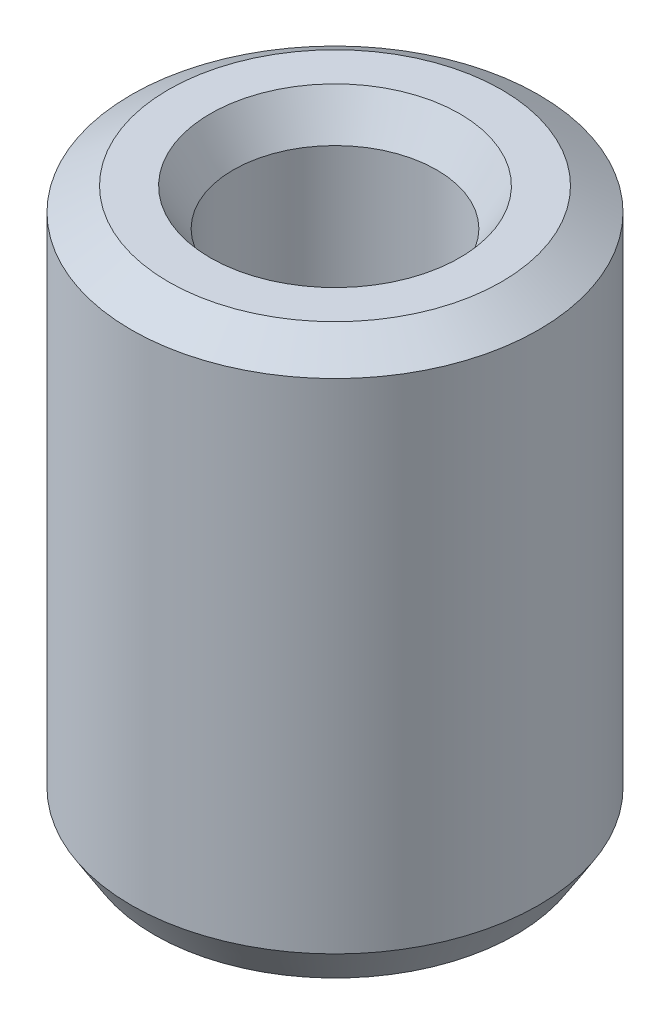
ISO-10303-21;
HEADER;
FILE_DESCRIPTION(('STEP AP214'),'2;1');
FILE_NAME('part.step','',(''),(''),'','','');
FILE_SCHEMA(('AUTOMOTIVE_DESIGN { 1 0 10303 214 1 1 1 1 }'));
ENDSEC;
DATA;
#1=APPLICATION_CONTEXT('core data for automotive mechanical design processes');
#2=APPLICATION_PROTOCOL_DEFINITION('international standard','automotive_design',2000,#1);
#3=PRODUCT_CONTEXT('',#1,'mechanical');
#4=PRODUCT('Part','Part','',(#3));
#5=PRODUCT_RELATED_PRODUCT_CATEGORY('part','',(#4));
#6=PRODUCT_DEFINITION_FORMATION('','',#4);
#7=PRODUCT_DEFINITION_CONTEXT('part definition',#1,'design');
#8=PRODUCT_DEFINITION('design','',#6,#7);
#9=PRODUCT_DEFINITION_SHAPE('','',#8);
#10=(LENGTH_UNIT() NAMED_UNIT(*) SI_UNIT(.MILLI.,.METRE.));
#11=(NAMED_UNIT(*) PLANE_ANGLE_UNIT() SI_UNIT($,.RADIAN.));
#12=(NAMED_UNIT(*) SI_UNIT($,.STERADIAN.) SOLID_ANGLE_UNIT());
#13=UNCERTAINTY_MEASURE_WITH_UNIT(LENGTH_MEASURE(1.E-05),#10,'distance_accuracy_value','');
#14=(GEOMETRIC_REPRESENTATION_CONTEXT(3) GLOBAL_UNCERTAINTY_ASSIGNED_CONTEXT((#13)) GLOBAL_UNIT_ASSIGNED_CONTEXT((#10,
#11,#12)) REPRESENTATION_CONTEXT('',''));
#15=CARTESIAN_POINT('',(0.,0.,0.));
#16=DIRECTION('',(0.,0.,1.));
#17=DIRECTION('',(1.,0.,0.));
#18=AXIS2_PLACEMENT_3D('',#15,#16,#17);
#19=CARTESIAN_POINT('',(0.,20.5635984561247,0.));
#20=DIRECTION('',(0.,-1.,0.));
#21=DIRECTION('',(0.,0.,-1.));
#22=AXIS2_PLACEMENT_3D('',#19,#20,#21);
#23=CYLINDRICAL_SURFACE('',#22,7.5);
#24=CARTESIAN_POINT('',(0.,1.36767746203423,0.));
#25=DIRECTION('',(0.,1.,0.));
#26=DIRECTION('',(0.,0.,1.));
#27=AXIS2_PLACEMENT_3D('',#24,#25,#26);
#28=CIRCLE('',#27,7.5);
#29=CARTESIAN_POINT('',(0.,1.36767746203423,7.5));
#30=VERTEX_POINT('',#29);
#31=EDGE_CURVE('E10',#30,#30,#28,.T.);
#32=ORIENTED_EDGE('',*,*,#31,.T.);
#33=EDGE_LOOP('',(#32));
#34=FACE_BOUND('',#33,.T.);
#35=CARTESIAN_POINT('',(0.,19.7164139908633,0.));
#36=DIRECTION('',(0.,1.,0.));
#37=DIRECTION('',(0.,0.,1.));
#38=AXIS2_PLACEMENT_3D('',#35,#36,#37);
#39=CIRCLE('',#38,7.5);
#40=CARTESIAN_POINT('',(0.,19.7164139908633,7.5));
#41=VERTEX_POINT('',#40);
#42=EDGE_CURVE('E50',#41,#41,#39,.F.);
#43=ORIENTED_EDGE('',*,*,#42,.T.);
#44=EDGE_LOOP('',(#43));
#45=FACE_BOUND('',#44,.T.);
#46=ADVANCED_FACE('F39',(#34,#45),#23,.T.);
#47=CARTESIAN_POINT('',(0.,20.5635984561247,0.));
#48=DIRECTION('',(0.,1.,0.));
#49=DIRECTION('',(0.,0.,1.));
#50=AXIS2_PLACEMENT_3D('',#47,#48,#49);
#51=PLANE('',#50);
#52=CARTESIAN_POINT('',(0.,20.5635984561247,0.));
#53=DIRECTION('',(0.,1.,0.));
#54=DIRECTION('',(0.,0.,1.));
#55=AXIS2_PLACEMENT_3D('',#52,#53,#54);
#56=CIRCLE('',#55,4.59432268061702);
#57=CARTESIAN_POINT('',(0.,20.5635984561247,4.59432268061701));
#58=VERTEX_POINT('',#57);
#59=EDGE_CURVE('E58',#58,#58,#56,.F.);
#60=ORIENTED_EDGE('',*,*,#59,.T.);
#61=EDGE_LOOP('',(#60));
#62=FACE_BOUND('',#61,.T.);
#63=CARTESIAN_POINT('',(0.,20.5635984561247,0.));
#64=DIRECTION('',(0.,1.,0.));
#65=DIRECTION('',(0.,0.,1.));
#66=AXIS2_PLACEMENT_3D('',#63,#64,#65);
#67=CIRCLE('',#66,6.13232253796576);
#68=CARTESIAN_POINT('',(0.,20.5635984561247,6.13232253796576));
#69=VERTEX_POINT('',#68);
#70=EDGE_CURVE('E61',#69,#69,#67,.T.);
#71=ORIENTED_EDGE('',*,*,#70,.T.);
#72=EDGE_LOOP('',(#71));
#73=FACE_BOUND('',#72,.T.);
#74=ADVANCED_FACE('F88',(#62,#73),#51,.T.);
#75=CARTESIAN_POINT('',(0.,0.,0.));
#76=DIRECTION('',(0.,1.,0.));
#77=DIRECTION('',(0.,0.,1.));
#78=AXIS2_PLACEMENT_3D('',#75,#76,#77);
#79=PLANE('',#78);
#80=CARTESIAN_POINT('',(0.,0.,0.));
#81=DIRECTION('',(0.,1.,0.));
#82=DIRECTION('',(0.,0.,1.));
#83=AXIS2_PLACEMENT_3D('',#80,#81,#82);
#84=CIRCLE('',#83,5.1148156773898);
#85=CARTESIAN_POINT('',(0.,0.,5.1148156773898));
#86=VERTEX_POINT('',#85);
#87=EDGE_CURVE('E51',#86,#86,#84,.T.);
#88=ORIENTED_EDGE('',*,*,#87,.T.);
#89=EDGE_LOOP('',(#88));
#90=FACE_BOUND('',#89,.T.);
#91=CARTESIAN_POINT('',(0.,0.,0.));
#92=DIRECTION('',(0.,1.,0.));
#93=DIRECTION('',(0.,0.,1.));
#94=AXIS2_PLACEMENT_3D('',#91,#92,#93);
#95=CIRCLE('',#94,6.65281553473856);
#96=CARTESIAN_POINT('',(0.,0.,6.65281553473856));
#97=VERTEX_POINT('',#96);
#98=EDGE_CURVE('E54',#97,#97,#95,.F.);
#99=ORIENTED_EDGE('',*,*,#98,.T.);
#100=EDGE_LOOP('',(#99));
#101=FACE_BOUND('',#100,.T.);
#102=ADVANCED_FACE('F83',(#90,#101),#79,.F.);
#103=CARTESIAN_POINT('',(0.,20.5635984561247,0.));
#104=DIRECTION('',(0.,-1.,0.));
#105=DIRECTION('',(0.,0.,-1.));
#106=AXIS2_PLACEMENT_3D('',#103,#104,#105);
#107=CYLINDRICAL_SURFACE('',#106,3.74713821535556);
#108=CARTESIAN_POINT('',(0.,19.1959209940905,0.));
#109=DIRECTION('',(0.,1.,0.));
#110=DIRECTION('',(0.,0.,1.));
#111=AXIS2_PLACEMENT_3D('',#108,#109,#110);
#112=CIRCLE('',#111,3.74713821535556);
#113=CARTESIAN_POINT('',(0.,19.1959209940905,3.74713821535556));
#114=VERTEX_POINT('',#113);
#115=EDGE_CURVE('E67',#114,#114,#112,.T.);
#116=ORIENTED_EDGE('',*,*,#115,.T.);
#117=EDGE_LOOP('',(#116));
#118=FACE_BOUND('',#117,.T.);
#119=CARTESIAN_POINT('',(0.,0.847184465261445,0.));
#120=DIRECTION('',(0.,1.,0.));
#121=DIRECTION('',(0.,0.,1.));
#122=AXIS2_PLACEMENT_3D('',#119,#120,#121);
#123=CIRCLE('',#122,3.74713821535556);
#124=CARTESIAN_POINT('',(0.,0.847184465261445,3.74713821535556));
#125=VERTEX_POINT('',#124);
#126=EDGE_CURVE('E69',#125,#125,#123,.F.);
#127=ORIENTED_EDGE('',*,*,#126,.T.);
#128=EDGE_LOOP('',(#127));
#129=FACE_BOUND('',#128,.T.);
#130=ADVANCED_FACE('F71',(#118,#129),#107,.F.);
#131=CARTESIAN_POINT('',(0.,19.1959209940905,0.));
#132=DIRECTION('',(0.,1.,0.));
#133=DIRECTION('',(0.,0.,1.));
#134=AXIS2_PLACEMENT_3D('',#131,#132,#133);
#135=CONICAL_SURFACE('',#134,3.74713821535556,0.554586013082697);
#136=CARTESIAN_POINT('',(0.,20.5635984561247,4.59432268061701));
#137=CARTESIAN_POINT('',(0.,20.5493518158952,4.58549784243721));
#138=CARTESIAN_POINT('',(0.,20.5351051756657,4.5766730042574));
#139=CARTESIAN_POINT('',(0.,20.5066118952067,4.55902332789779));
#140=CARTESIAN_POINT('',(0.,20.4923652549771,4.55019848971798));
#141=CARTESIAN_POINT('',(0.,20.4638719745181,4.53254881335837));
#142=CARTESIAN_POINT('',(0.,20.4496253342886,4.52372397517856));
#143=CARTESIAN_POINT('',(0.,20.4211320538295,4.50607429881895));
#144=CARTESIAN_POINT('',(0.,20.4068854136,4.49724946063914));
#145=CARTESIAN_POINT('',(0.,20.3783921331409,4.47959978427953));
#146=CARTESIAN_POINT('',(0.,20.3641454929114,4.47077494609972));
#147=CARTESIAN_POINT('',(0.,20.3356522124524,4.45312526974011));
#148=CARTESIAN_POINT('',(0.,20.3214055722229,4.4443004315603));
#149=CARTESIAN_POINT('',(0.,20.2929122917638,4.42665075520069));
#150=CARTESIAN_POINT('',(0.,20.2786656515343,4.41782591702088));
#151=CARTESIAN_POINT('',(0.,20.2501723710752,4.40017624066127));
#152=CARTESIAN_POINT('',(0.,20.2359257308457,4.39135140248146));
#153=CARTESIAN_POINT('',(0.,20.2074324503867,4.37370172612184));
#154=CARTESIAN_POINT('',(0.,20.1931858101571,4.36487688794204));
#155=CARTESIAN_POINT('',(0.,20.1646925296981,4.34722721158242));
#156=CARTESIAN_POINT('',(0.,20.1504458894686,4.33840237340262));
#157=CARTESIAN_POINT('',(0.,20.1219526090095,4.320752697043));
#158=CARTESIAN_POINT('',(0.,20.10770596878,4.3119278588632));
#159=CARTESIAN_POINT('',(0.,20.079212688321,4.29427818250358));
#160=CARTESIAN_POINT('',(0.,20.0649660480914,4.28545334432378));
#161=CARTESIAN_POINT('',(0.,20.0364727676324,4.26780366796416));
#162=CARTESIAN_POINT('',(0.,20.0222261274029,4.25897882978436));
#163=CARTESIAN_POINT('',(0.,19.9937328469438,4.24132915342474));
#164=CARTESIAN_POINT('',(0.,19.9794862067143,4.23250431524494));
#165=CARTESIAN_POINT('',(0.,19.9509929262552,4.21485463888532));
#166=CARTESIAN_POINT('',(0.,19.9367462860257,4.20602980070552));
#167=CARTESIAN_POINT('',(0.,19.9082530055667,4.1883801243459));
#168=CARTESIAN_POINT('',(0.,19.8940063653371,4.1795552861661));
#169=CARTESIAN_POINT('',(0.,19.8655130848781,4.16190560980648));
#170=CARTESIAN_POINT('',(0.,19.8512664446486,4.15308077162668));
#171=CARTESIAN_POINT('',(0.,19.8227731641895,4.13543109526706));
#172=CARTESIAN_POINT('',(0.,19.80852652396,4.12660625708725));
#173=CARTESIAN_POINT('',(0.,19.780033243501,4.10895658072764));
#174=CARTESIAN_POINT('',(0.,19.7657866032714,4.10013174254783));
#175=CARTESIAN_POINT('',(0.,19.7372933228124,4.08248206618822));
#176=CARTESIAN_POINT('',(0.,19.7230466825829,4.07365722800841));
#177=CARTESIAN_POINT('',(0.,19.6945534021238,4.0560075516488));
#178=CARTESIAN_POINT('',(0.,19.6803067618943,4.04718271346899));
#179=CARTESIAN_POINT('',(0.,19.6518134814353,4.02953303710938));
#180=CARTESIAN_POINT('',(0.,19.6375668412057,4.02070819892957));
#181=CARTESIAN_POINT('',(0.,19.6090735607467,4.00305852256996));
#182=CARTESIAN_POINT('',(0.,19.5948269205172,3.99423368439015));
#183=CARTESIAN_POINT('',(0.,19.5663336400581,3.97658400803054));
#184=CARTESIAN_POINT('',(0.,19.5520869998286,3.96775916985073));
#185=CARTESIAN_POINT('',(0.,19.5235937193695,3.95010949349112));
#186=CARTESIAN_POINT('',(0.,19.50934707914,3.94128465531131));
#187=CARTESIAN_POINT('',(0.,19.480853798681,3.9236349789517));
#188=CARTESIAN_POINT('',(0.,19.4666071584514,3.91481014077189));
#189=CARTESIAN_POINT('',(0.,19.4381138779924,3.89716046441228));
#190=CARTESIAN_POINT('',(0.,19.4238672377629,3.88833562623247));
#191=CARTESIAN_POINT('',(0.,19.3953739573038,3.87068594987286));
#192=CARTESIAN_POINT('',(0.,19.3811273170743,3.86186111169305));
#193=CARTESIAN_POINT('',(0.,19.3526340366153,3.84421143533344));
#194=CARTESIAN_POINT('',(0.,19.3383873963857,3.83538659715363));
#195=CARTESIAN_POINT('',(0.,19.3098941159267,3.81773692079402));
#196=CARTESIAN_POINT('',(0.,19.2956474756972,3.80891208261421));
#197=CARTESIAN_POINT('',(0.,19.2671541952381,3.7912624062546));
#198=CARTESIAN_POINT('',(0.,19.2529075550086,3.78243756807479));
#199=CARTESIAN_POINT('',(0.,19.2244142745496,3.76478789171518));
#200=CARTESIAN_POINT('',(0.,19.21016763432,3.75596305353537));
#201=CARTESIAN_POINT('',(0.,19.1959209940905,3.74713821535556));
#202=B_SPLINE_CURVE_WITH_KNOTS('',3,(#136,#137,#138,#139,#140,#141,#142,#143,#144,#145,#146,
#147,#148,#149,#150,#151,#152,#153,#154,#155,#156,#157,#158,#159,#160,#161,#162,#163,#164,#165,
#166,#167,#168,#169,#170,#171,#172,#173,#174,#175,#176,#177,#178,#179,#180,#181,#182,#183,#184,
#185,#186,#187,#188,#189,#190,#191,#192,#193,#194,#195,#196,#197,#198,#199,#200,#201),
.UNSPECIFIED.,.F.,.F.,(4,2,2,2,2,2,2,2,2,2,2,2,2,2,2,2,2,2,2,2,2,2,2,2,2,2,2,2,2,2,2,2,4),(0.,
0.050275249781212,0.100550499562424,0.150825749343637,0.201100999124849,0.251376248906061,
0.301651498687273,0.351926748468485,0.402201998249695,0.452477248030907,0.502752497812119,
0.553027747593331,0.603302997374543,0.653578247155755,0.703853496936967,0.754128746718179,
0.804403996499389,0.854679246280601,0.904954496061813,0.955229745843025,1.00550499562424,
1.05578024540545,1.10605549518666,1.15633074496787,1.20660599474909,1.2568812445303,
1.30715649431151,1.35743174409272,1.40770699387393,1.45798224365514,1.50825749343636,
1.55853274321757,1.60880799299878),.UNSPECIFIED.);
#203=EDGE_CURVE('BSEAM77',#58,#114,#202,.T.);
#204=ORIENTED_EDGE('',*,*,#59,.F.);
#205=ORIENTED_EDGE('',*,*,#115,.F.);
#206=ORIENTED_EDGE('',*,*,#203,.T.);
#207=ORIENTED_EDGE('',*,*,#203,.F.);
#208=EDGE_LOOP('',(#204,#206,#205,#207));
#209=FACE_BOUND('',#208,.T.);
#210=ADVANCED_FACE('F77',(#209),#135,.F.);
#211=CARTESIAN_POINT('',(0.,0.,0.));
#212=DIRECTION('',(0.,-1.,0.));
#213=DIRECTION('',(0.,0.,-1.));
#214=AXIS2_PLACEMENT_3D('',#211,#212,#213);
#215=CONICAL_SURFACE('',#214,5.1148156773898,1.0162103137122);
#216=ORIENTED_EDGE('',*,*,#126,.F.);
#217=EDGE_LOOP('',(#216));
#218=FACE_BOUND('',#217,.T.);
#219=ORIENTED_EDGE('',*,*,#87,.F.);
#220=EDGE_LOOP('',(#219));
#221=FACE_BOUND('',#220,.T.);
#222=ADVANCED_FACE('F73',(#218,#221),#215,.F.);
#223=CARTESIAN_POINT('',(0.,1.36767746203423,0.));
#224=DIRECTION('',(0.,1.,0.));
#225=DIRECTION('',(0.,0.,1.));
#226=AXIS2_PLACEMENT_3D('',#223,#224,#225);
#227=CONICAL_SURFACE('',#226,7.5,0.554586013082695);
#228=ORIENTED_EDGE('',*,*,#98,.F.);
#229=EDGE_LOOP('',(#228));
#230=FACE_BOUND('',#229,.T.);
#231=ORIENTED_EDGE('',*,*,#31,.F.);
#232=EDGE_LOOP('',(#231));
#233=FACE_BOUND('',#232,.T.);
#234=ADVANCED_FACE('F76',(#230,#233),#227,.T.);
#235=CARTESIAN_POINT('',(0.,20.5635984561247,0.));
#236=DIRECTION('',(0.,-1.,0.));
#237=DIRECTION('',(0.,0.,-1.));
#238=AXIS2_PLACEMENT_3D('',#235,#236,#237);
#239=CONICAL_SURFACE('',#238,6.13232253796576,1.0162103137122);
#240=ORIENTED_EDGE('',*,*,#42,.F.);
#241=EDGE_LOOP('',(#240));
#242=FACE_BOUND('',#241,.T.);
#243=ORIENTED_EDGE('',*,*,#70,.F.);
#244=EDGE_LOOP('',(#243));
#245=FACE_BOUND('',#244,.T.);
#246=ADVANCED_FACE('F45',(#242,#245),#239,.T.);
#247=CLOSED_SHELL('',(#46,#74,#102,#130,#210,#222,#234,#246));
#248=MANIFOLD_SOLID_BREP('B2',#247);
#249=ADVANCED_BREP_SHAPE_REPRESENTATION('',(#18,#248),#14);
#250=SHAPE_DEFINITION_REPRESENTATION(#9,#249);
ENDSEC;
END-ISO-10303-21;
